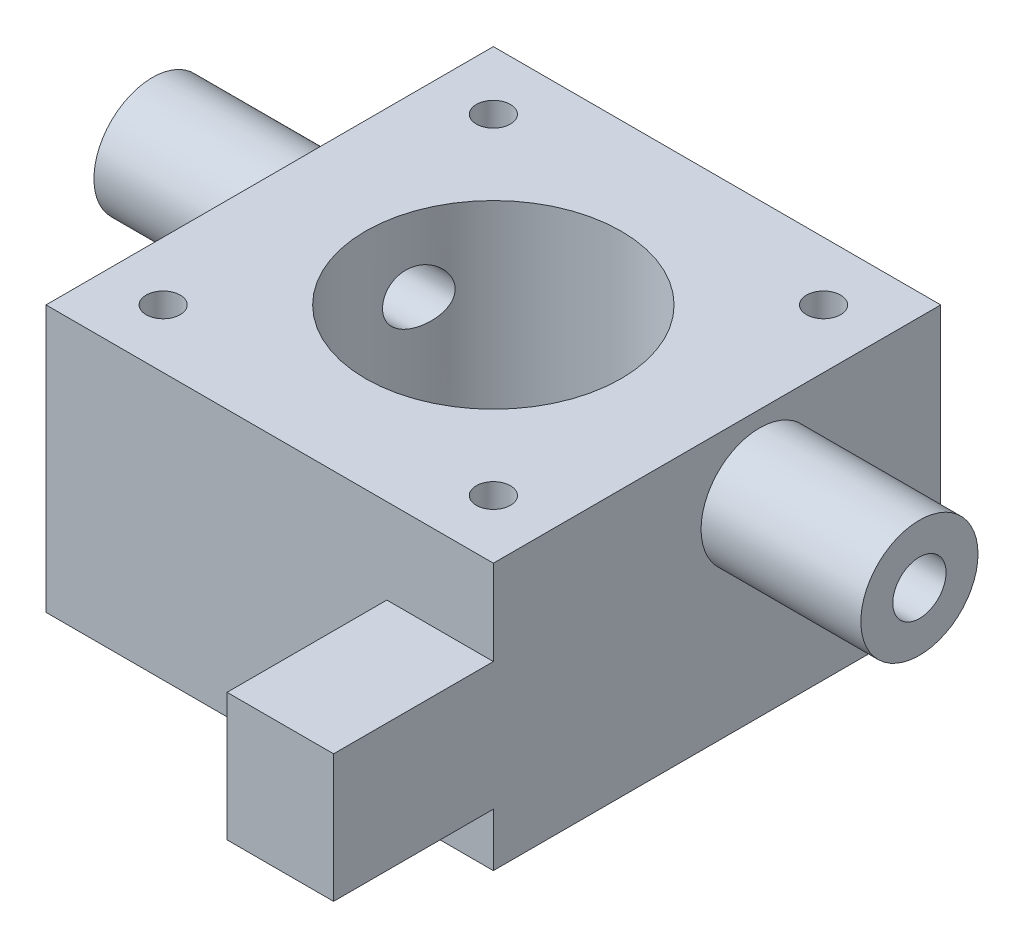
ISO-10303-21;
HEADER;
FILE_DESCRIPTION(('STEP AP214'),'2;1');
FILE_NAME('part.step','',(''),(''),'','','');
FILE_SCHEMA(('AUTOMOTIVE_DESIGN { 1 0 10303 214 1 1 1 1 }'));
ENDSEC;
DATA;
#1=APPLICATION_CONTEXT('core data for automotive mechanical design processes');
#2=APPLICATION_PROTOCOL_DEFINITION('international standard','automotive_design',2000,#1);
#3=PRODUCT_CONTEXT('',#1,'mechanical');
#4=PRODUCT('Part','Part','',(#3));
#5=PRODUCT_RELATED_PRODUCT_CATEGORY('part','',(#4));
#6=PRODUCT_DEFINITION_FORMATION('','',#4);
#7=PRODUCT_DEFINITION_CONTEXT('part definition',#1,'design');
#8=PRODUCT_DEFINITION('design','',#6,#7);
#9=PRODUCT_DEFINITION_SHAPE('','',#8);
#10=(LENGTH_UNIT() NAMED_UNIT(*) SI_UNIT(.MILLI.,.METRE.));
#11=(NAMED_UNIT(*) PLANE_ANGLE_UNIT() SI_UNIT($,.RADIAN.));
#12=(NAMED_UNIT(*) SI_UNIT($,.STERADIAN.) SOLID_ANGLE_UNIT());
#13=UNCERTAINTY_MEASURE_WITH_UNIT(LENGTH_MEASURE(1.E-05),#10,'distance_accuracy_value','');
#14=(GEOMETRIC_REPRESENTATION_CONTEXT(3) GLOBAL_UNCERTAINTY_ASSIGNED_CONTEXT((#13)) GLOBAL_UNIT_ASSIGNED_CONTEXT((#10,
#11,#12)) REPRESENTATION_CONTEXT('',''));
#15=CARTESIAN_POINT('',(0.,0.,0.));
#16=DIRECTION('',(0.,0.,1.));
#17=DIRECTION('',(1.,0.,0.));
#18=AXIS2_PLACEMENT_3D('',#15,#16,#17);
#19=CARTESIAN_POINT('',(-36.001,18.,-3.99999999999999));
#20=DIRECTION('',(1.,0.,0.));
#21=DIRECTION('',(0.,0.,-1.));
#22=AXIS2_PLACEMENT_3D('',#19,#20,#21);
#23=CYLINDRICAL_SURFACE('',#22,2.5);
#24=CARTESIAN_POINT('',(-10.087120500916,18.,-6.49999999999999));
#25=CARTESIAN_POINT('',(-10.0871281492212,17.8739728712813,-6.49999147871605));
#26=CARTESIAN_POINT('',(-10.093319059034,17.7478724740335,-6.490411551228));
#27=CARTESIAN_POINT('',(-10.1175074504485,17.4996140930368,-6.45263645705285));
#28=CARTESIAN_POINT('',(-10.1355169312869,17.3774602485615,-6.42442237116731));
#29=CARTESIAN_POINT('',(-10.1816441149555,17.1410668800005,-6.35106068213065));
#30=CARTESIAN_POINT('',(-10.2097153412217,17.0267938009456,-6.30599089686566));
#31=CARTESIAN_POINT('',(-10.2739222461714,16.8078985082295,-6.20083088918113));
#32=CARTESIAN_POINT('',(-10.3100595046799,16.7032781908536,-6.14073772398317));
#33=CARTESIAN_POINT('',(-10.3913044022423,16.4975691791642,-6.00230825044209));
#34=CARTESIAN_POINT('',(-10.4368898058327,16.3973802764985,-5.922920067616));
#35=CARTESIAN_POINT('',(-10.5325112956204,16.2112906324166,-5.75116308498263));
#36=CARTESIAN_POINT('',(-10.5825494655568,16.1253966350555,-5.65878819600068));
#37=CARTESIAN_POINT('',(-10.6922905279477,15.9576654456518,-5.44893100246377));
#38=CARTESIAN_POINT('',(-10.7523496348631,15.8781808344419,-5.32974807298646));
#39=CARTESIAN_POINT('',(-10.8727295327847,15.7406421156556,-5.07966838573672));
#40=CARTESIAN_POINT('',(-10.9330504400568,15.6825987900219,-4.94876577560912));
#41=CARTESIAN_POINT('',(-11.0554461803433,15.5864255523437,-4.66924356061103));
#42=CARTESIAN_POINT('',(-11.1173792985636,15.5498391386183,-4.52002531806655));
#43=CARTESIAN_POINT('',(-11.2363778823208,15.5045576670908,-4.2155078601965));
#44=CARTESIAN_POINT('',(-11.2934443254413,15.4958569948897,-4.06020987531507));
#45=CARTESIAN_POINT('',(-11.3988717478068,15.5076002243212,-3.75380472965782));
#46=CARTESIAN_POINT('',(-11.4474676851784,15.5270336740789,-3.60274137610973));
#47=CARTESIAN_POINT('',(-11.5370680660274,15.5938211293038,-3.30458200789416));
#48=CARTESIAN_POINT('',(-11.5780762493189,15.6411613318099,-3.15748406947947));
#49=CARTESIAN_POINT('',(-11.6492673396337,15.7586810294626,-2.88326225862947));
#50=CARTESIAN_POINT('',(-11.6800213805584,15.8269445343868,-2.75546398689912));
#51=CARTESIAN_POINT('',(-11.73466058534,15.9853814168137,-2.5126161623176));
#52=CARTESIAN_POINT('',(-11.7585475832379,16.0755489323293,-2.39756321051787));
#53=CARTESIAN_POINT('',(-11.7990533775089,16.2705970523342,-2.18931573486885));
#54=CARTESIAN_POINT('',(-11.8159575076655,16.3746030475584,-2.0953557540945));
#55=CARTESIAN_POINT('',(-11.8447629563887,16.5972943208842,-1.92587628916078));
#56=CARTESIAN_POINT('',(-11.8566646664011,16.7159784494619,-1.85035536231541));
#57=CARTESIAN_POINT('',(-11.8761378894703,16.9631394054344,-1.72093053297686));
#58=CARTESIAN_POINT('',(-11.883758269068,17.0914859310847,-1.66678487018232));
#59=CARTESIAN_POINT('',(-11.8955414107768,17.3555270255422,-1.58050734970739));
#60=CARTESIAN_POINT('',(-11.8997041561164,17.4912216299881,-1.54837559880648));
#61=CARTESIAN_POINT('',(-11.9050089788098,17.7663530355073,-1.50705114548142));
#62=CARTESIAN_POINT('',(-11.9061459066967,17.9057958086449,-1.49789754977541));
#63=CARTESIAN_POINT('',(-11.9055137028222,18.1842561490295,-1.50291345150471));
#64=CARTESIAN_POINT('',(-11.9037445356407,18.3232737110732,-1.51708323320986));
#65=CARTESIAN_POINT('',(-11.8970961485933,18.5971436241863,-1.56836368775856));
#66=CARTESIAN_POINT('',(-11.892212462908,18.7319897022999,-1.60550729981381));
#67=CARTESIAN_POINT('',(-11.8788358932079,18.9934626371108,-1.70164556603794));
#68=CARTESIAN_POINT('',(-11.8703430769531,19.1200896480665,-1.76063980996696));
#69=CARTESIAN_POINT('',(-11.8490642650783,19.3613254213816,-1.8985561973728));
#70=CARTESIAN_POINT('',(-11.8362848971541,19.4759523809228,-1.97744753032599));
#71=CARTESIAN_POINT('',(-11.805664866088,19.6901696660051,-2.15271123466614));
#72=CARTESIAN_POINT('',(-11.787824494556,19.7897608573858,-2.24908259875558));
#73=CARTESIAN_POINT('',(-11.7464455328485,19.9710571327337,-2.45603529459806));
#74=CARTESIAN_POINT('',(-11.7229164083084,20.0527915033985,-2.56659287967015));
#75=CARTESIAN_POINT('',(-11.6697310816972,20.1965822102538,-2.79848339424549));
#76=CARTESIAN_POINT('',(-11.6400748672654,20.2586385067457,-2.9198163454864));
#77=CARTESIAN_POINT('',(-11.5742126021935,20.3624705452567,-3.17090274997363));
#78=CARTESIAN_POINT('',(-11.5379353547179,20.4040056093613,-3.30073679663193));
#79=CARTESIAN_POINT('',(-11.4594493819971,20.4653335229269,-3.5636856318218));
#80=CARTESIAN_POINT('',(-11.4172395572149,20.4851223359535,-3.69680102473439));
#81=CARTESIAN_POINT('',(-11.325784851187,20.5036573455532,-3.96837184695809));
#82=CARTESIAN_POINT('',(-11.2763178083158,20.5014773469244,-4.1068147991979));
#83=CARTESIAN_POINT('',(-11.1730923245727,20.47477911853,-4.37987976961835));
#84=CARTESIAN_POINT('',(-11.1193325566206,20.4502539562551,-4.51450058862904));
#85=CARTESIAN_POINT('',(-11.0052936912764,20.377638924653,-4.78609129832382));
#86=CARTESIAN_POINT('',(-10.9448211737133,20.3280297686117,-4.92257419546036));
#87=CARTESIAN_POINT('',(-10.8231016134676,20.2062046397441,-5.18472700530779));
#88=CARTESIAN_POINT('',(-10.7618542113288,20.1339777761504,-5.3103916716346));
#89=CARTESIAN_POINT('',(-10.6381911479662,19.9641312520706,-5.55414256442107));
#90=CARTESIAN_POINT('',(-10.5758765303412,19.8653997545542,-5.67151014256896));
#91=CARTESIAN_POINT('',(-10.4570683518373,19.646303093892,-5.88769526236553));
#92=CARTESIAN_POINT('',(-10.4005763508502,19.5259321570711,-5.98650783888501));
#93=CARTESIAN_POINT('',(-10.2999729510131,19.2711589796902,-6.15792600534775));
#94=CARTESIAN_POINT('',(-10.2554393972643,19.1375641648106,-6.23146225716031));
#95=CARTESIAN_POINT('',(-10.1989581286467,18.9266861977693,-6.32317488745182));
#96=CARTESIAN_POINT('',(-10.1818586863355,18.8546963293038,-6.35063526542263));
#97=CARTESIAN_POINT('',(-10.1515532521922,18.7077626144447,-6.39896703989852));
#98=CARTESIAN_POINT('',(-10.1383452075,18.6328203492949,-6.41984191092143));
#99=CARTESIAN_POINT('',(-10.1141430778322,18.4661174186716,-6.45791945041131));
#100=CARTESIAN_POINT('',(-10.1040560240955,18.3738821907868,-6.47365546642893));
#101=CARTESIAN_POINT('',(-10.0905423675841,18.1877780439549,-6.49469816205291));
#102=CARTESIAN_POINT('',(-10.0871148017664,18.0939093632063,-6.50000634965151));
#103=CARTESIAN_POINT('',(-10.087120500916,18.,-6.49999999999999));
#104=B_SPLINE_CURVE_WITH_KNOTS('',3,(#24,#25,#26,#27,#28,#29,#30,#31,#32,#33,#34,#35,#36,#37,
#38,#39,#40,#41,#42,#43,#44,#45,#46,#47,#48,#49,#50,#51,#52,#53,#54,#55,#56,#57,#58,#59,#60,#61,
#62,#63,#64,#65,#66,#67,#68,#69,#70,#71,#72,#73,#74,#75,#76,#77,#78,#79,#80,#81,#82,#83,#84,#85,
#86,#87,#88,#89,#90,#91,#92,#93,#94,#95,#96,#97,#98,#99,#100,#101,#102,#103),.UNSPECIFIED.,.T.,
.F.,(4,2,2,2,2,2,2,2,2,2,2,2,2,2,2,2,2,2,2,2,2,2,2,2,2,2,2,2,2,2,2,2,2,2,2,2,2,2,2,4),(0.,
0.377712044708326,0.755808169929945,1.13217986065697,1.50862533288271,1.9142017457553,
2.31996896248673,2.78398749620942,3.24823904919819,3.74273275908105,4.23712690340497,
4.71419905865029,5.19103544695087,5.63311975308704,6.07508587798687,6.49658701578433,
6.91805516442781,7.33460956140457,7.75116597888279,8.16843085809893,8.58570082305819,
9.00357044889409,9.42143222973571,9.83865088478523,10.2558455049882,10.6723506667824,
11.0888566688313,11.5101379945524,11.9314975032819,12.3706932171479,12.8100252363737,
13.2798908797421,13.7499831193028,14.2441718865072,14.7384927057268,15.2119339146762,
15.4483460437381,15.6846332321921,15.9661268167356,16.2475796908473),.UNSPECIFIED.);
#105=CARTESIAN_POINT('',(-10.087120500916,18.,-6.49999999999999));
#106=VERTEX_POINT('',#105);
#107=EDGE_CURVE('E200',#106,#106,#104,.T.);
#108=ORIENTED_EDGE('',*,*,#107,.F.);
#109=EDGE_LOOP('',(#108));
#110=FACE_BOUND('',#109,.T.);
#111=CARTESIAN_POINT('',(-36.,18.,-3.99999999999999));
#112=DIRECTION('',(1.,0.,0.));
#113=DIRECTION('',(0.,0.,-1.));
#114=AXIS2_PLACEMENT_3D('',#111,#112,#113);
#115=CIRCLE('',#114,2.5);
#116=CARTESIAN_POINT('',(-36.,18.,-6.49999999999999));
#117=VERTEX_POINT('',#116);
#118=EDGE_CURVE('E191',#117,#117,#115,.F.);
#119=ORIENTED_EDGE('',*,*,#118,.T.);
#120=EDGE_LOOP('',(#119));
#121=FACE_BOUND('',#120,.T.);
#122=ADVANCED_FACE('F36',(#110,#121),#23,.F.);
#123=CARTESIAN_POINT('',(-21.,25.,21.));
#124=DIRECTION('',(0.,0.,-1.));
#125=DIRECTION('',(-1.,0.,0.));
#126=AXIS2_PLACEMENT_3D('',#123,#124,#125);
#127=PLANE('',#126);
#128=DIRECTION('',(1.,0.,0.));
#129=VECTOR('',#128,1.);
#130=CARTESIAN_POINT('',(11.,5.,21.));
#131=LINE('',#130,#129);
#132=CARTESIAN_POINT('',(11.,5.,21.));
#133=VERTEX_POINT('',#132);
#134=CARTESIAN_POINT('',(21.,5.,21.));
#135=VERTEX_POINT('',#134);
#136=EDGE_CURVE('E52',#133,#135,#131,.T.);
#137=ORIENTED_EDGE('',*,*,#136,.F.);
#138=DIRECTION('',(0.,-1.,0.));
#139=VECTOR('',#138,1.);
#140=CARTESIAN_POINT('',(11.,17.,21.));
#141=LINE('',#140,#139);
#142=CARTESIAN_POINT('',(11.,17.,21.));
#143=VERTEX_POINT('',#142);
#144=EDGE_CURVE('E177',#143,#133,#141,.T.);
#145=ORIENTED_EDGE('',*,*,#144,.F.);
#146=DIRECTION('',(-1.,0.,0.));
#147=VECTOR('',#146,1.);
#148=CARTESIAN_POINT('',(21.,17.,21.));
#149=LINE('',#148,#147);
#150=CARTESIAN_POINT('',(21.,17.,21.));
#151=VERTEX_POINT('',#150);
#152=EDGE_CURVE('E179',#151,#143,#149,.T.);
#153=ORIENTED_EDGE('',*,*,#152,.F.);
#154=DIRECTION('',(0.,-1.,0.));
#155=VECTOR('',#154,1.);
#156=CARTESIAN_POINT('',(21.,25.,21.));
#157=LINE('',#156,#155);
#158=CARTESIAN_POINT('',(21.,25.,21.));
#159=VERTEX_POINT('',#158);
#160=EDGE_CURVE('E125',#159,#151,#157,.T.);
#161=ORIENTED_EDGE('',*,*,#160,.F.);
#162=DIRECTION('',(1.,0.,0.));
#163=VECTOR('',#162,1.);
#164=CARTESIAN_POINT('',(-21.,25.,21.));
#165=LINE('',#164,#163);
#166=CARTESIAN_POINT('',(-21.,25.,21.));
#167=VERTEX_POINT('',#166);
#168=EDGE_CURVE('E142',#167,#159,#165,.T.);
#169=ORIENTED_EDGE('',*,*,#168,.F.);
#170=DIRECTION('',(0.,-1.,0.));
#171=VECTOR('',#170,1.);
#172=CARTESIAN_POINT('',(-21.,25.,21.));
#173=LINE('',#172,#171);
#174=CARTESIAN_POINT('',(-21.,0.,21.));
#175=VERTEX_POINT('',#174);
#176=EDGE_CURVE('E149',#167,#175,#173,.T.);
#177=ORIENTED_EDGE('',*,*,#176,.T.);
#178=DIRECTION('',(1.,0.,0.));
#179=VECTOR('',#178,1.);
#180=CARTESIAN_POINT('',(-21.,0.,21.));
#181=LINE('',#180,#179);
#182=CARTESIAN_POINT('',(21.,0.,21.));
#183=VERTEX_POINT('',#182);
#184=EDGE_CURVE('E138',#175,#183,#181,.T.);
#185=ORIENTED_EDGE('',*,*,#184,.T.);
#186=EDGE_CURVE('E57',#135,#183,#157,.T.);
#187=ORIENTED_EDGE('',*,*,#186,.F.);
#188=EDGE_LOOP('',(#137,#145,#153,#161,#169,#177,#185,#187));
#189=FACE_BOUND('',#188,.T.);
#190=ADVANCED_FACE('F164',(#189),#127,.F.);
#191=CARTESIAN_POINT('',(21.,25.,-21.));
#192=DIRECTION('',(-1.,0.,0.));
#193=DIRECTION('',(0.,0.,1.));
#194=AXIS2_PLACEMENT_3D('',#191,#192,#193);
#195=PLANE('',#194);
#196=CARTESIAN_POINT('',(21.,18.,-4.));
#197=DIRECTION('',(-1.,0.,0.));
#198=DIRECTION('',(0.,0.,1.));
#199=AXIS2_PLACEMENT_3D('',#196,#197,#198);
#200=CIRCLE('',#199,5.5);
#201=CARTESIAN_POINT('',(21.,18.,1.5));
#202=VERTEX_POINT('',#201);
#203=EDGE_CURVE('E180',#202,#202,#200,.T.);
#204=ORIENTED_EDGE('',*,*,#203,.T.);
#205=EDGE_LOOP('',(#204));
#206=FACE_BOUND('',#205,.T.);
#207=DIRECTION('',(0.,0.,-1.));
#208=VECTOR('',#207,1.);
#209=CARTESIAN_POINT('',(21.,0.,-21.));
#210=LINE('',#209,#208);
#211=CARTESIAN_POINT('',(21.,0.,-21.));
#212=VERTEX_POINT('',#211);
#213=EDGE_CURVE('E126',#183,#212,#210,.T.);
#214=ORIENTED_EDGE('',*,*,#213,.T.);
#215=DIRECTION('',(0.,-1.,0.));
#216=VECTOR('',#215,1.);
#217=CARTESIAN_POINT('',(21.,25.,-21.));
#218=LINE('',#217,#216);
#219=CARTESIAN_POINT('',(21.,25.,-21.));
#220=VERTEX_POINT('',#219);
#221=EDGE_CURVE('E12',#220,#212,#218,.T.);
#222=ORIENTED_EDGE('',*,*,#221,.F.);
#223=DIRECTION('',(0.,0.,-1.));
#224=VECTOR('',#223,1.);
#225=CARTESIAN_POINT('',(21.,25.,-21.));
#226=LINE('',#225,#224);
#227=EDGE_CURVE('E134',#159,#220,#226,.T.);
#228=ORIENTED_EDGE('',*,*,#227,.F.);
#229=ORIENTED_EDGE('',*,*,#160,.T.);
#230=DIRECTION('',(0.,0.,-1.));
#231=VECTOR('',#230,1.);
#232=CARTESIAN_POINT('',(21.,17.,36.));
#233=LINE('',#232,#231);
#234=CARTESIAN_POINT('',(21.,17.,36.));
#235=VERTEX_POINT('',#234);
#236=EDGE_CURVE('E105',#235,#151,#233,.T.);
#237=ORIENTED_EDGE('',*,*,#236,.F.);
#238=DIRECTION('',(0.,1.,0.));
#239=VECTOR('',#238,1.);
#240=CARTESIAN_POINT('',(21.,5.,36.));
#241=LINE('',#240,#239);
#242=CARTESIAN_POINT('',(21.,5.,36.));
#243=VERTEX_POINT('',#242);
#244=EDGE_CURVE('E111',#243,#235,#241,.T.);
#245=ORIENTED_EDGE('',*,*,#244,.F.);
#246=DIRECTION('',(0.,0.,-1.));
#247=VECTOR('',#246,1.);
#248=CARTESIAN_POINT('',(21.,5.,36.));
#249=LINE('',#248,#247);
#250=EDGE_CURVE('E170',#243,#135,#249,.T.);
#251=ORIENTED_EDGE('',*,*,#250,.T.);
#252=ORIENTED_EDGE('',*,*,#186,.T.);
#253=EDGE_LOOP('',(#214,#222,#228,#229,#237,#245,#251,#252));
#254=FACE_BOUND('',#253,.T.);
#255=ADVANCED_FACE('F38',(#206,#254),#195,.F.);
#256=CARTESIAN_POINT('',(-21.,25.,-21.));
#257=DIRECTION('',(0.,0.,1.));
#258=DIRECTION('',(1.,0.,0.));
#259=AXIS2_PLACEMENT_3D('',#256,#257,#258);
#260=PLANE('',#259);
#261=DIRECTION('',(-1.,0.,0.));
#262=VECTOR('',#261,1.);
#263=CARTESIAN_POINT('',(-21.,0.,-21.));
#264=LINE('',#263,#262);
#265=CARTESIAN_POINT('',(-21.,0.,-21.));
#266=VERTEX_POINT('',#265);
#267=EDGE_CURVE('E128',#212,#266,#264,.T.);
#268=ORIENTED_EDGE('',*,*,#267,.T.);
#269=DIRECTION('',(0.,-1.,0.));
#270=VECTOR('',#269,1.);
#271=CARTESIAN_POINT('',(-21.,25.,-21.));
#272=LINE('',#271,#270);
#273=CARTESIAN_POINT('',(-21.,25.,-21.));
#274=VERTEX_POINT('',#273);
#275=EDGE_CURVE('E45',#274,#266,#272,.T.);
#276=ORIENTED_EDGE('',*,*,#275,.F.);
#277=DIRECTION('',(-1.,0.,0.));
#278=VECTOR('',#277,1.);
#279=CARTESIAN_POINT('',(-21.,25.,-21.));
#280=LINE('',#279,#278);
#281=EDGE_CURVE('E137',#220,#274,#280,.T.);
#282=ORIENTED_EDGE('',*,*,#281,.F.);
#283=ORIENTED_EDGE('',*,*,#221,.T.);
#284=EDGE_LOOP('',(#268,#276,#282,#283));
#285=FACE_BOUND('',#284,.T.);
#286=ADVANCED_FACE('F169',(#285),#260,.F.);
#287=CARTESIAN_POINT('',(-21.,25.,-21.));
#288=DIRECTION('',(1.,0.,0.));
#289=DIRECTION('',(0.,0.,-1.));
#290=AXIS2_PLACEMENT_3D('',#287,#288,#289);
#291=PLANE('',#290);
#292=CARTESIAN_POINT('',(-21.,18.,-3.99999999999999));
#293=DIRECTION('',(1.,0.,0.));
#294=DIRECTION('',(0.,0.,-1.));
#295=AXIS2_PLACEMENT_3D('',#292,#293,#294);
#296=CIRCLE('',#295,5.5);
#297=CARTESIAN_POINT('',(-21.,18.,-9.49999999999999));
#298=VERTEX_POINT('',#297);
#299=EDGE_CURVE('E40',#298,#298,#296,.T.);
#300=ORIENTED_EDGE('',*,*,#299,.T.);
#301=EDGE_LOOP('',(#300));
#302=FACE_BOUND('',#301,.T.);
#303=DIRECTION('',(0.,0.,1.));
#304=VECTOR('',#303,1.);
#305=CARTESIAN_POINT('',(-21.,0.,-21.));
#306=LINE('',#305,#304);
#307=EDGE_CURVE('E145',#266,#175,#306,.T.);
#308=ORIENTED_EDGE('',*,*,#307,.T.);
#309=ORIENTED_EDGE('',*,*,#176,.F.);
#310=DIRECTION('',(0.,0.,1.));
#311=VECTOR('',#310,1.);
#312=CARTESIAN_POINT('',(-21.,25.,-21.));
#313=LINE('',#312,#311);
#314=EDGE_CURVE('E140',#274,#167,#313,.T.);
#315=ORIENTED_EDGE('',*,*,#314,.F.);
#316=ORIENTED_EDGE('',*,*,#275,.T.);
#317=EDGE_LOOP('',(#308,#309,#315,#316));
#318=FACE_BOUND('',#317,.T.);
#319=ADVANCED_FACE('F157',(#302,#318),#291,.F.);
#320=CARTESIAN_POINT('',(0.,25.,0.));
#321=DIRECTION('',(0.,1.,0.));
#322=DIRECTION('',(0.,0.,1.));
#323=AXIS2_PLACEMENT_3D('',#320,#321,#322);
#324=PLANE('',#323);
#325=CARTESIAN_POINT('',(-15.5,25.,15.5));
#326=DIRECTION('',(0.,1.,0.));
#327=DIRECTION('',(0.,0.,-1.));
#328=AXIS2_PLACEMENT_3D('',#325,#326,#327);
#329=CIRCLE('',#328,1.6);
#330=CARTESIAN_POINT('',(-15.5,25.,13.9));
#331=VERTEX_POINT('',#330);
#332=EDGE_CURVE('E432',#331,#331,#329,.T.);
#333=ORIENTED_EDGE('',*,*,#332,.F.);
#334=EDGE_LOOP('',(#333));
#335=FACE_BOUND('',#334,.T.);
#336=CARTESIAN_POINT('',(15.5,25.,15.5));
#337=DIRECTION('',(0.,1.,0.));
#338=DIRECTION('',(0.,0.,1.));
#339=AXIS2_PLACEMENT_3D('',#336,#337,#338);
#340=CIRCLE('',#339,1.6);
#341=CARTESIAN_POINT('',(15.5,25.,17.1));
#342=VERTEX_POINT('',#341);
#343=EDGE_CURVE('E436',#342,#342,#340,.T.);
#344=ORIENTED_EDGE('',*,*,#343,.F.);
#345=EDGE_LOOP('',(#344));
#346=FACE_BOUND('',#345,.T.);
#347=CARTESIAN_POINT('',(15.5,25.,-15.5));
#348=DIRECTION('',(0.,1.,0.));
#349=DIRECTION('',(0.,0.,-1.));
#350=AXIS2_PLACEMENT_3D('',#347,#348,#349);
#351=CIRCLE('',#350,1.6);
#352=CARTESIAN_POINT('',(15.5,25.,-17.1));
#353=VERTEX_POINT('',#352);
#354=EDGE_CURVE('E440',#353,#353,#351,.T.);
#355=ORIENTED_EDGE('',*,*,#354,.F.);
#356=EDGE_LOOP('',(#355));
#357=FACE_BOUND('',#356,.T.);
#358=CARTESIAN_POINT('',(-15.5,25.,-15.5));
#359=DIRECTION('',(0.,1.,0.));
#360=DIRECTION('',(0.,0.,1.));
#361=AXIS2_PLACEMENT_3D('',#358,#359,#360);
#362=CIRCLE('',#361,1.6);
#363=CARTESIAN_POINT('',(-15.5,25.,-13.9));
#364=VERTEX_POINT('',#363);
#365=EDGE_CURVE('E443',#364,#364,#362,.T.);
#366=ORIENTED_EDGE('',*,*,#365,.F.);
#367=EDGE_LOOP('',(#366));
#368=FACE_BOUND('',#367,.T.);
#369=CARTESIAN_POINT('',(0.,25.,0.));
#370=DIRECTION('',(0.,1.,0.));
#371=DIRECTION('',(0.,0.,1.));
#372=AXIS2_PLACEMENT_3D('',#369,#370,#371);
#373=CIRCLE('',#372,12.);
#374=CARTESIAN_POINT('',(0.,25.,12.));
#375=VERTEX_POINT('',#374);
#376=EDGE_CURVE('E446',#375,#375,#373,.T.);
#377=ORIENTED_EDGE('',*,*,#376,.F.);
#378=EDGE_LOOP('',(#377));
#379=FACE_BOUND('',#378,.T.);
#380=ORIENTED_EDGE('',*,*,#227,.T.);
#381=ORIENTED_EDGE('',*,*,#281,.T.);
#382=ORIENTED_EDGE('',*,*,#314,.T.);
#383=ORIENTED_EDGE('',*,*,#168,.T.);
#384=EDGE_LOOP('',(#380,#381,#382,#383));
#385=FACE_BOUND('',#384,.T.);
#386=ADVANCED_FACE('F167',(#335,#346,#357,#368,#379,#385),#324,.T.);
#387=CARTESIAN_POINT('',(0.,0.,0.));
#388=DIRECTION('',(0.,1.,0.));
#389=DIRECTION('',(0.,0.,1.));
#390=AXIS2_PLACEMENT_3D('',#387,#388,#389);
#391=PLANE('',#390);
#392=CARTESIAN_POINT('',(-15.5,0.,15.5));
#393=DIRECTION('',(0.,1.,0.));
#394=DIRECTION('',(0.,0.,1.));
#395=AXIS2_PLACEMENT_3D('',#392,#393,#394);
#396=CIRCLE('',#395,1.6);
#397=CARTESIAN_POINT('',(-15.5,0.,17.1));
#398=VERTEX_POINT('',#397);
#399=EDGE_CURVE('E452',#398,#398,#396,.F.);
#400=ORIENTED_EDGE('',*,*,#399,.F.);
#401=EDGE_LOOP('',(#400));
#402=FACE_BOUND('',#401,.T.);
#403=CARTESIAN_POINT('',(15.5,0.,15.5));
#404=DIRECTION('',(0.,1.,0.));
#405=DIRECTION('',(0.,0.,1.));
#406=AXIS2_PLACEMENT_3D('',#403,#404,#405);
#407=CIRCLE('',#406,1.6);
#408=CARTESIAN_POINT('',(15.5,0.,17.1));
#409=VERTEX_POINT('',#408);
#410=EDGE_CURVE('E456',#409,#409,#407,.F.);
#411=ORIENTED_EDGE('',*,*,#410,.F.);
#412=EDGE_LOOP('',(#411));
#413=FACE_BOUND('',#412,.T.);
#414=CARTESIAN_POINT('',(15.5,0.,-15.5));
#415=DIRECTION('',(0.,1.,0.));
#416=DIRECTION('',(0.,0.,1.));
#417=AXIS2_PLACEMENT_3D('',#414,#415,#416);
#418=CIRCLE('',#417,1.6);
#419=CARTESIAN_POINT('',(15.5,0.,-13.9));
#420=VERTEX_POINT('',#419);
#421=EDGE_CURVE('E460',#420,#420,#418,.F.);
#422=ORIENTED_EDGE('',*,*,#421,.F.);
#423=EDGE_LOOP('',(#422));
#424=FACE_BOUND('',#423,.T.);
#425=CARTESIAN_POINT('',(-15.5,0.,-15.5));
#426=DIRECTION('',(0.,1.,0.));
#427=DIRECTION('',(0.,0.,1.));
#428=AXIS2_PLACEMENT_3D('',#425,#426,#427);
#429=CIRCLE('',#428,1.6);
#430=CARTESIAN_POINT('',(-15.5,0.,-13.9));
#431=VERTEX_POINT('',#430);
#432=EDGE_CURVE('E448',#431,#431,#429,.F.);
#433=ORIENTED_EDGE('',*,*,#432,.F.);
#434=EDGE_LOOP('',(#433));
#435=FACE_BOUND('',#434,.T.);
#436=CARTESIAN_POINT('',(0.,0.,0.));
#437=DIRECTION('',(0.,1.,0.));
#438=DIRECTION('',(0.,0.,1.));
#439=AXIS2_PLACEMENT_3D('',#436,#437,#438);
#440=CIRCLE('',#439,12.);
#441=CARTESIAN_POINT('',(0.,0.,12.));
#442=VERTEX_POINT('',#441);
#443=EDGE_CURVE('E197',#442,#442,#440,.F.);
#444=ORIENTED_EDGE('',*,*,#443,.F.);
#445=EDGE_LOOP('',(#444));
#446=FACE_BOUND('',#445,.T.);
#447=ORIENTED_EDGE('',*,*,#213,.F.);
#448=ORIENTED_EDGE('',*,*,#184,.F.);
#449=ORIENTED_EDGE('',*,*,#307,.F.);
#450=ORIENTED_EDGE('',*,*,#267,.F.);
#451=EDGE_LOOP('',(#447,#448,#449,#450));
#452=FACE_BOUND('',#451,.T.);
#453=ADVANCED_FACE('F163',(#402,#413,#424,#435,#446,#452),#391,.F.);
#454=CARTESIAN_POINT('',(21.,17.,36.));
#455=DIRECTION('',(0.,-1.,0.));
#456=DIRECTION('',(0.,0.,-1.));
#457=AXIS2_PLACEMENT_3D('',#454,#455,#456);
#458=PLANE('',#457);
#459=ORIENTED_EDGE('',*,*,#152,.T.);
#460=DIRECTION('',(0.,0.,-1.));
#461=VECTOR('',#460,1.);
#462=CARTESIAN_POINT('',(11.,17.,36.));
#463=LINE('',#462,#461);
#464=CARTESIAN_POINT('',(11.,17.,36.));
#465=VERTEX_POINT('',#464);
#466=EDGE_CURVE('E107',#465,#143,#463,.T.);
#467=ORIENTED_EDGE('',*,*,#466,.F.);
#468=DIRECTION('',(-1.,0.,0.));
#469=VECTOR('',#468,1.);
#470=CARTESIAN_POINT('',(21.,17.,36.));
#471=LINE('',#470,#469);
#472=EDGE_CURVE('E100',#235,#465,#471,.T.);
#473=ORIENTED_EDGE('',*,*,#472,.F.);
#474=ORIENTED_EDGE('',*,*,#236,.T.);
#475=EDGE_LOOP('',(#459,#467,#473,#474));
#476=FACE_BOUND('',#475,.T.);
#477=ADVANCED_FACE('F103',(#476),#458,.F.);
#478=CARTESIAN_POINT('',(11.,17.,36.));
#479=DIRECTION('',(1.,0.,0.));
#480=DIRECTION('',(0.,1.,0.));
#481=AXIS2_PLACEMENT_3D('',#478,#479,#480);
#482=PLANE('',#481);
#483=ORIENTED_EDGE('',*,*,#144,.T.);
#484=DIRECTION('',(0.,0.,-1.));
#485=VECTOR('',#484,1.);
#486=CARTESIAN_POINT('',(11.,5.,36.));
#487=LINE('',#486,#485);
#488=CARTESIAN_POINT('',(11.,5.,36.));
#489=VERTEX_POINT('',#488);
#490=EDGE_CURVE('E130',#489,#133,#487,.T.);
#491=ORIENTED_EDGE('',*,*,#490,.F.);
#492=DIRECTION('',(0.,-1.,0.));
#493=VECTOR('',#492,1.);
#494=CARTESIAN_POINT('',(11.,17.,36.));
#495=LINE('',#494,#493);
#496=EDGE_CURVE('E110',#465,#489,#495,.T.);
#497=ORIENTED_EDGE('',*,*,#496,.F.);
#498=ORIENTED_EDGE('',*,*,#466,.T.);
#499=EDGE_LOOP('',(#483,#491,#497,#498));
#500=FACE_BOUND('',#499,.T.);
#501=ADVANCED_FACE('F289',(#500),#482,.F.);
#502=CARTESIAN_POINT('',(11.,5.,36.));
#503=DIRECTION('',(0.,1.,0.));
#504=DIRECTION('',(-1.,0.,0.));
#505=AXIS2_PLACEMENT_3D('',#502,#503,#504);
#506=PLANE('',#505);
#507=ORIENTED_EDGE('',*,*,#136,.T.);
#508=ORIENTED_EDGE('',*,*,#250,.F.);
#509=DIRECTION('',(1.,0.,0.));
#510=VECTOR('',#509,1.);
#511=CARTESIAN_POINT('',(11.,5.,36.));
#512=LINE('',#511,#510);
#513=EDGE_CURVE('E116',#489,#243,#512,.T.);
#514=ORIENTED_EDGE('',*,*,#513,.F.);
#515=ORIENTED_EDGE('',*,*,#490,.T.);
#516=EDGE_LOOP('',(#507,#508,#514,#515));
#517=FACE_BOUND('',#516,.T.);
#518=ADVANCED_FACE('F292',(#517),#506,.F.);
#519=CARTESIAN_POINT('',(0.,0.,36.));
#520=DIRECTION('',(0.,0.,1.));
#521=DIRECTION('',(1.,0.,0.));
#522=AXIS2_PLACEMENT_3D('',#519,#520,#521);
#523=PLANE('',#522);
#524=ORIENTED_EDGE('',*,*,#244,.T.);
#525=ORIENTED_EDGE('',*,*,#472,.T.);
#526=ORIENTED_EDGE('',*,*,#496,.T.);
#527=ORIENTED_EDGE('',*,*,#513,.T.);
#528=EDGE_LOOP('',(#524,#525,#526,#527));
#529=FACE_BOUND('',#528,.T.);
#530=ADVANCED_FACE('F114',(#529),#523,.T.);
#531=CARTESIAN_POINT('',(-36.,25.,-21.));
#532=DIRECTION('',(1.,0.,0.));
#533=DIRECTION('',(0.,0.,-1.));
#534=AXIS2_PLACEMENT_3D('',#531,#532,#533);
#535=PLANE('',#534);
#536=ORIENTED_EDGE('',*,*,#118,.F.);
#537=EDGE_LOOP('',(#536));
#538=FACE_BOUND('',#537,.T.);
#539=CARTESIAN_POINT('',(-36.,18.,-3.99999999999999));
#540=DIRECTION('',(1.,0.,0.));
#541=DIRECTION('',(0.,0.,-1.));
#542=AXIS2_PLACEMENT_3D('',#539,#540,#541);
#543=CIRCLE('',#542,5.5);
#544=CARTESIAN_POINT('',(-36.,18.,-9.49999999999999));
#545=VERTEX_POINT('',#544);
#546=EDGE_CURVE('E185',#545,#545,#543,.F.);
#547=ORIENTED_EDGE('',*,*,#546,.T.);
#548=EDGE_LOOP('',(#547));
#549=FACE_BOUND('',#548,.T.);
#550=ADVANCED_FACE('F297',(#538,#549),#535,.F.);
#551=CARTESIAN_POINT('',(-66.556349186104,18.,-3.99999999999999));
#552=DIRECTION('',(1.,0.,0.));
#553=DIRECTION('',(0.,0.,-1.));
#554=AXIS2_PLACEMENT_3D('',#551,#552,#553);
#555=CYLINDRICAL_SURFACE('',#554,5.5);
#556=ORIENTED_EDGE('',*,*,#546,.F.);
#557=EDGE_LOOP('',(#556));
#558=FACE_BOUND('',#557,.T.);
#559=ORIENTED_EDGE('',*,*,#299,.F.);
#560=EDGE_LOOP('',(#559));
#561=FACE_BOUND('',#560,.T.);
#562=ADVANCED_FACE('F267',(#558,#561),#555,.T.);
#563=CARTESIAN_POINT('',(36.,18.,-4.));
#564=DIRECTION('',(1.,0.,0.));
#565=DIRECTION('',(0.,0.,-1.));
#566=AXIS2_PLACEMENT_3D('',#563,#564,#565);
#567=CIRCLE('',#566,5.5);
#568=CARTESIAN_POINT('',(36.,18.,-9.5));
#569=VERTEX_POINT('',#568);
#570=EDGE_CURVE('E188',#569,#569,#567,.T.);
#571=ORIENTED_EDGE('',*,*,#570,.F.);
#572=EDGE_LOOP('',(#571));
#573=FACE_BOUND('',#572,.T.);
#574=ORIENTED_EDGE('',*,*,#203,.F.);
#575=EDGE_LOOP('',(#574));
#576=FACE_BOUND('',#575,.T.);
#577=ADVANCED_FACE('F256',(#573,#576),#555,.T.);
#578=CARTESIAN_POINT('',(36.,18.,-4.));
#579=DIRECTION('',(1.,0.,0.));
#580=DIRECTION('',(0.,0.,-1.));
#581=AXIS2_PLACEMENT_3D('',#578,#579,#580);
#582=PLANE('',#581);
#583=CARTESIAN_POINT('',(36.,18.,-4.));
#584=DIRECTION('',(1.,0.,0.));
#585=DIRECTION('',(0.,0.,-1.));
#586=AXIS2_PLACEMENT_3D('',#583,#584,#585);
#587=CIRCLE('',#586,2.5);
#588=CARTESIAN_POINT('',(36.,18.,-6.5));
#589=VERTEX_POINT('',#588);
#590=EDGE_CURVE('E194',#589,#589,#587,.T.);
#591=ORIENTED_EDGE('',*,*,#590,.F.);
#592=EDGE_LOOP('',(#591));
#593=FACE_BOUND('',#592,.T.);
#594=ORIENTED_EDGE('',*,*,#570,.T.);
#595=EDGE_LOOP('',(#594));
#596=FACE_BOUND('',#595,.T.);
#597=ADVANCED_FACE('F251',(#593,#596),#582,.T.);
#598=CARTESIAN_POINT('',(10.087120500916,18.,-6.5));
#599=CARTESIAN_POINT('',(10.0871281492212,18.1260271287187,-6.49999147871605));
#600=CARTESIAN_POINT('',(10.093319059034,18.2521275259665,-6.490411551228));
#601=CARTESIAN_POINT('',(10.1175074504485,18.5003859069632,-6.45263645705285));
#602=CARTESIAN_POINT('',(10.1355169312869,18.6225397514385,-6.42442237116731));
#603=CARTESIAN_POINT('',(10.1816441149555,18.8589331199995,-6.35106068213066));
#604=CARTESIAN_POINT('',(10.2097153412217,18.9732061990543,-6.30599089686566));
#605=CARTESIAN_POINT('',(10.2739222461714,19.1921014917705,-6.20083088918113));
#606=CARTESIAN_POINT('',(10.3100595046799,19.2967218091464,-6.14073772398318));
#607=CARTESIAN_POINT('',(10.3913044022423,19.5024308208357,-6.00230825044209));
#608=CARTESIAN_POINT('',(10.4368898058327,19.6026197235015,-5.922920067616));
#609=CARTESIAN_POINT('',(10.5325112956204,19.7887093675834,-5.75116308498264));
#610=CARTESIAN_POINT('',(10.5825494655568,19.8746033649445,-5.65878819600069));
#611=CARTESIAN_POINT('',(10.6922905279477,20.0423345543482,-5.44893100246377));
#612=CARTESIAN_POINT('',(10.7523496348631,20.1218191655581,-5.32974807298646));
#613=CARTESIAN_POINT('',(10.8727295327847,20.2593578843444,-5.07966838573672));
#614=CARTESIAN_POINT('',(10.9330504400568,20.3174012099781,-4.94876577560913));
#615=CARTESIAN_POINT('',(11.0554461803433,20.4135744476563,-4.66924356061103));
#616=CARTESIAN_POINT('',(11.1173792985636,20.4501608613817,-4.52002531806655));
#617=CARTESIAN_POINT('',(11.2363778823208,20.4954423329092,-4.2155078601965));
#618=CARTESIAN_POINT('',(11.2934443254413,20.5041430051103,-4.06020987531508));
#619=CARTESIAN_POINT('',(11.3988717478068,20.4923997756788,-3.75380472965782));
#620=CARTESIAN_POINT('',(11.4474676851784,20.4729663259211,-3.60274137610973));
#621=CARTESIAN_POINT('',(11.5370680660274,20.4061788706962,-3.30458200789416));
#622=CARTESIAN_POINT('',(11.5780762493189,20.3588386681901,-3.15748406947948));
#623=CARTESIAN_POINT('',(11.6492673396337,20.2413189705374,-2.88326225862947));
#624=CARTESIAN_POINT('',(11.6800213805584,20.1730554656132,-2.75546398689912));
#625=CARTESIAN_POINT('',(11.73466058534,20.0146185831863,-2.5126161623176));
#626=CARTESIAN_POINT('',(11.7585475832379,19.9244510676707,-2.39756321051788));
#627=CARTESIAN_POINT('',(11.7990533775089,19.7294029476658,-2.18931573486885));
#628=CARTESIAN_POINT('',(11.8159575076655,19.6253969524416,-2.0953557540945));
#629=CARTESIAN_POINT('',(11.8447629563887,19.4027056791158,-1.92587628916078));
#630=CARTESIAN_POINT('',(11.8566646664011,19.2840215505381,-1.85035536231542));
#631=CARTESIAN_POINT('',(11.8761378894703,19.0368605945656,-1.72093053297686));
#632=CARTESIAN_POINT('',(11.883758269068,18.9085140689153,-1.66678487018232));
#633=CARTESIAN_POINT('',(11.8955414107768,18.6444729744578,-1.5805073497074));
#634=CARTESIAN_POINT('',(11.8997041561164,18.5087783700119,-1.54837559880648));
#635=CARTESIAN_POINT('',(11.9050089788098,18.2336469644927,-1.50705114548142));
#636=CARTESIAN_POINT('',(11.9061459066967,18.0942041913551,-1.49789754977542));
#637=CARTESIAN_POINT('',(11.9055137028222,17.8157438509705,-1.50291345150471));
#638=CARTESIAN_POINT('',(11.9037445356407,17.6767262889268,-1.51708323320986));
#639=CARTESIAN_POINT('',(11.8970961485933,17.4028563758137,-1.56836368775856));
#640=CARTESIAN_POINT('',(11.892212462908,17.2680102977001,-1.60550729981382));
#641=CARTESIAN_POINT('',(11.8788358932079,17.0065373628892,-1.70164556603794));
#642=CARTESIAN_POINT('',(11.8703430769531,16.8799103519335,-1.76063980996697));
#643=CARTESIAN_POINT('',(11.8490642650783,16.6386745786184,-1.8985561973728));
#644=CARTESIAN_POINT('',(11.8362848971541,16.5240476190772,-1.977447530326));
#645=CARTESIAN_POINT('',(11.805664866088,16.3098303339949,-2.15271123466615));
#646=CARTESIAN_POINT('',(11.787824494556,16.2102391426142,-2.24908259875559));
#647=CARTESIAN_POINT('',(11.7464455328485,16.0289428672663,-2.45603529459806));
#648=CARTESIAN_POINT('',(11.7229164083084,15.9472084966015,-2.56659287967015));
#649=CARTESIAN_POINT('',(11.6697310816972,15.8034177897462,-2.7984833942455));
#650=CARTESIAN_POINT('',(11.6400748672654,15.7413614932543,-2.91981634548641));
#651=CARTESIAN_POINT('',(11.5742126021935,15.6375294547433,-3.17090274997364));
#652=CARTESIAN_POINT('',(11.5379353547179,15.5959943906387,-3.30073679663194));
#653=CARTESIAN_POINT('',(11.4594493819971,15.5346664770731,-3.5636856318218));
#654=CARTESIAN_POINT('',(11.4172395572149,15.5148776640465,-3.69680102473439));
#655=CARTESIAN_POINT('',(11.325784851187,15.4963426544468,-3.96837184695809));
#656=CARTESIAN_POINT('',(11.2763178083158,15.4985226530756,-4.10681479919791));
#657=CARTESIAN_POINT('',(11.1730923245727,15.52522088147,-4.37987976961835));
#658=CARTESIAN_POINT('',(11.1193325566206,15.5497460437449,-4.51450058862905));
#659=CARTESIAN_POINT('',(11.0052936912764,15.622361075347,-4.78609129832383));
#660=CARTESIAN_POINT('',(10.9448211737133,15.6719702313883,-4.92257419546036));
#661=CARTESIAN_POINT('',(10.8231016134676,15.7937953602559,-5.1847270053078));
#662=CARTESIAN_POINT('',(10.7618542113288,15.8660222238496,-5.31039167163461));
#663=CARTESIAN_POINT('',(10.6381911479662,16.0358687479294,-5.55414256442108));
#664=CARTESIAN_POINT('',(10.5758765303412,16.1346002454458,-5.67151014256897));
#665=CARTESIAN_POINT('',(10.4570683518373,16.353696906108,-5.88769526236554));
#666=CARTESIAN_POINT('',(10.4005763508502,16.4740678429289,-5.98650783888501));
#667=CARTESIAN_POINT('',(10.2999729510131,16.7288410203098,-6.15792600534775));
#668=CARTESIAN_POINT('',(10.2554393972643,16.8624358351894,-6.23146225716031));
#669=CARTESIAN_POINT('',(10.1989581286467,17.0733138022307,-6.32317488745182));
#670=CARTESIAN_POINT('',(10.1818586863355,17.1453036706962,-6.35063526542264));
#671=CARTESIAN_POINT('',(10.1515532521922,17.2922373855553,-6.39896703989852));
#672=CARTESIAN_POINT('',(10.1383452075,17.3671796507051,-6.41984191092143));
#673=CARTESIAN_POINT('',(10.1141430778322,17.5338825813284,-6.45791945041132));
#674=CARTESIAN_POINT('',(10.1040560240955,17.6261178092132,-6.47365546642894));
#675=CARTESIAN_POINT('',(10.0905423675841,17.8122219560451,-6.49469816205292));
#676=CARTESIAN_POINT('',(10.0871148017664,17.9060906367937,-6.50000634965151));
#677=CARTESIAN_POINT('',(10.087120500916,18.,-6.5));
#678=B_SPLINE_CURVE_WITH_KNOTS('',3,(#598,#599,#600,#601,#602,#603,#604,#605,#606,#607,#608,
#609,#610,#611,#612,#613,#614,#615,#616,#617,#618,#619,#620,#621,#622,#623,#624,#625,#626,#627,
#628,#629,#630,#631,#632,#633,#634,#635,#636,#637,#638,#639,#640,#641,#642,#643,#644,#645,#646,
#647,#648,#649,#650,#651,#652,#653,#654,#655,#656,#657,#658,#659,#660,#661,#662,#663,#664,#665,
#666,#667,#668,#669,#670,#671,#672,#673,#674,#675,#676,#677),.UNSPECIFIED.,.T.,.F.,(4,2,2,2,2,2,
2,2,2,2,2,2,2,2,2,2,2,2,2,2,2,2,2,2,2,2,2,2,2,2,2,2,2,2,2,2,2,2,2,4),(0.,0.377712044708326,
0.755808169929945,1.13217986065697,1.50862533288271,1.9142017457553,2.31996896248673,
2.78398749620942,3.24823904919819,3.74273275908105,4.23712690340497,4.71419905865029,
5.19103544695087,5.63311975308704,6.07508587798687,6.49658701578433,6.91805516442781,
7.33460956140458,7.75116597888279,8.16843085809894,8.5857008230582,9.00357044889409,
9.42143222973571,9.83865088478523,10.2558455049882,10.6723506667824,11.0888566688313,
11.5101379945524,11.9314975032819,12.3706932171479,12.8100252363737,13.2798908797421,
13.7499831193028,14.2441718865072,14.7384927057268,15.2119339146762,15.4483460437381,
15.6846332321921,15.9661268167356,16.2475796908473),.UNSPECIFIED.);
#679=CARTESIAN_POINT('',(10.087120500916,18.,-6.5));
#680=VERTEX_POINT('',#679);
#681=EDGE_CURVE('E208',#680,#680,#678,.T.);
#682=ORIENTED_EDGE('',*,*,#681,.F.);
#683=EDGE_LOOP('',(#682));
#684=FACE_BOUND('',#683,.T.);
#685=ORIENTED_EDGE('',*,*,#590,.T.);
#686=EDGE_LOOP('',(#685));
#687=FACE_BOUND('',#686,.T.);
#688=ADVANCED_FACE('F237',(#684,#687),#23,.F.);
#689=CARTESIAN_POINT('',(0.,-0.001000000000001,0.));
#690=DIRECTION('',(0.,1.,0.));
#691=DIRECTION('',(0.,0.,1.));
#692=AXIS2_PLACEMENT_3D('',#689,#690,#691);
#693=CYLINDRICAL_SURFACE('',#692,12.);
#694=ORIENTED_EDGE('',*,*,#107,.T.);
#695=EDGE_LOOP('',(#694));
#696=FACE_BOUND('',#695,.T.);
#697=ORIENTED_EDGE('',*,*,#681,.T.);
#698=EDGE_LOOP('',(#697));
#699=FACE_BOUND('',#698,.T.);
#700=ORIENTED_EDGE('',*,*,#376,.T.);
#701=EDGE_LOOP('',(#700));
#702=FACE_BOUND('',#701,.T.);
#703=ORIENTED_EDGE('',*,*,#443,.T.);
#704=EDGE_LOOP('',(#703));
#705=FACE_BOUND('',#704,.T.);
#706=ADVANCED_FACE('F213',(#696,#699,#702,#705),#693,.F.);
#707=CARTESIAN_POINT('',(-15.5,-0.001000000000001,-15.5));
#708=DIRECTION('',(0.,1.,0.));
#709=DIRECTION('',(0.,0.,1.));
#710=AXIS2_PLACEMENT_3D('',#707,#708,#709);
#711=CYLINDRICAL_SURFACE('',#710,1.6);
#712=ORIENTED_EDGE('',*,*,#365,.T.);
#713=EDGE_LOOP('',(#712));
#714=FACE_BOUND('',#713,.T.);
#715=ORIENTED_EDGE('',*,*,#432,.T.);
#716=EDGE_LOOP('',(#715));
#717=FACE_BOUND('',#716,.T.);
#718=ADVANCED_FACE('F230',(#714,#717),#711,.F.);
#719=CARTESIAN_POINT('',(15.5,-0.001000000000001,-15.5));
#720=DIRECTION('',(0.,1.,0.));
#721=DIRECTION('',(0.,0.,1.));
#722=AXIS2_PLACEMENT_3D('',#719,#720,#721);
#723=CYLINDRICAL_SURFACE('',#722,1.6);
#724=ORIENTED_EDGE('',*,*,#354,.T.);
#725=EDGE_LOOP('',(#724));
#726=FACE_BOUND('',#725,.T.);
#727=ORIENTED_EDGE('',*,*,#421,.T.);
#728=EDGE_LOOP('',(#727));
#729=FACE_BOUND('',#728,.T.);
#730=ADVANCED_FACE('F226',(#726,#729),#723,.F.);
#731=CARTESIAN_POINT('',(15.5,-0.001000000000001,15.5));
#732=DIRECTION('',(0.,1.,0.));
#733=DIRECTION('',(0.,0.,1.));
#734=AXIS2_PLACEMENT_3D('',#731,#732,#733);
#735=CYLINDRICAL_SURFACE('',#734,1.6);
#736=ORIENTED_EDGE('',*,*,#343,.T.);
#737=EDGE_LOOP('',(#736));
#738=FACE_BOUND('',#737,.T.);
#739=ORIENTED_EDGE('',*,*,#410,.T.);
#740=EDGE_LOOP('',(#739));
#741=FACE_BOUND('',#740,.T.);
#742=ADVANCED_FACE('F222',(#738,#741),#735,.F.);
#743=CARTESIAN_POINT('',(-15.5,-0.001000000000001,15.5));
#744=DIRECTION('',(0.,1.,0.));
#745=DIRECTION('',(0.,0.,1.));
#746=AXIS2_PLACEMENT_3D('',#743,#744,#745);
#747=CYLINDRICAL_SURFACE('',#746,1.6);
#748=ORIENTED_EDGE('',*,*,#332,.T.);
#749=EDGE_LOOP('',(#748));
#750=FACE_BOUND('',#749,.T.);
#751=ORIENTED_EDGE('',*,*,#399,.T.);
#752=EDGE_LOOP('',(#751));
#753=FACE_BOUND('',#752,.T.);
#754=ADVANCED_FACE('F218',(#750,#753),#747,.F.);
#755=CLOSED_SHELL('',(#122,#190,#255,#286,#319,#386,#453,#477,#501,#518,#530,#550,#562,#577,
#597,#688,#706,#718,#730,#742,#754));
#756=MANIFOLD_SOLID_BREP('B2',#755);
#757=ADVANCED_BREP_SHAPE_REPRESENTATION('',(#18,#756),#14);
#758=SHAPE_DEFINITION_REPRESENTATION(#9,#757);
ENDSEC;
END-ISO-10303-21;
